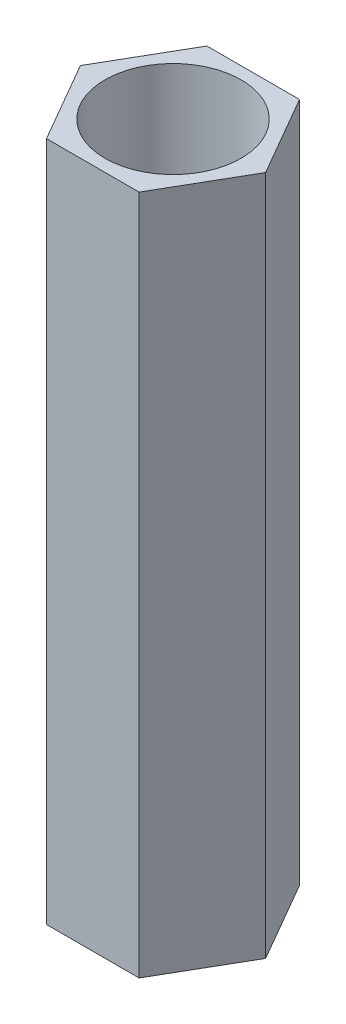
ISO-10303-21;
HEADER;
FILE_DESCRIPTION(('STEP AP214'),'2;1');
FILE_NAME('part.step','',(''),(''),'','','');
FILE_SCHEMA(('AUTOMOTIVE_DESIGN { 1 0 10303 214 1 1 1 1 }'));
ENDSEC;
DATA;
#1=APPLICATION_CONTEXT('core data for automotive mechanical design processes');
#2=APPLICATION_PROTOCOL_DEFINITION('international standard','automotive_design',2000,#1);
#3=PRODUCT_CONTEXT('',#1,'mechanical');
#4=PRODUCT('Part','Part','',(#3));
#5=PRODUCT_RELATED_PRODUCT_CATEGORY('part','',(#4));
#6=PRODUCT_DEFINITION_FORMATION('','',#4);
#7=PRODUCT_DEFINITION_CONTEXT('part definition',#1,'design');
#8=PRODUCT_DEFINITION('design','',#6,#7);
#9=PRODUCT_DEFINITION_SHAPE('','',#8);
#10=(LENGTH_UNIT() NAMED_UNIT(*) SI_UNIT(.MILLI.,.METRE.));
#11=(NAMED_UNIT(*) PLANE_ANGLE_UNIT() SI_UNIT($,.RADIAN.));
#12=(NAMED_UNIT(*) SI_UNIT($,.STERADIAN.) SOLID_ANGLE_UNIT());
#13=UNCERTAINTY_MEASURE_WITH_UNIT(LENGTH_MEASURE(1.E-05),#10,'distance_accuracy_value','');
#14=(GEOMETRIC_REPRESENTATION_CONTEXT(3) GLOBAL_UNCERTAINTY_ASSIGNED_CONTEXT((#13)) GLOBAL_UNIT_ASSIGNED_CONTEXT((#10,
#11,#12)) REPRESENTATION_CONTEXT('',''));
#15=CARTESIAN_POINT('',(0.,0.,0.));
#16=DIRECTION('',(0.,0.,1.));
#17=DIRECTION('',(1.,0.,0.));
#18=AXIS2_PLACEMENT_3D('',#15,#16,#17);
#19=CARTESIAN_POINT('',(0.,14.,0.));
#20=DIRECTION('',(0.,1.,0.));
#21=DIRECTION('',(0.,0.,1.));
#22=AXIS2_PLACEMENT_3D('',#19,#20,#21);
#23=PLANE('',#22);
#24=DIRECTION('',(0.5,0.,-0.866025403784439));
#25=VECTOR('',#24,1.);
#26=CARTESIAN_POINT('',(0.952627944162883,14.,1.65));
#27=LINE('',#26,#25);
#28=CARTESIAN_POINT('',(0.952627944162883,14.,1.65));
#29=VERTEX_POINT('',#28);
#30=CARTESIAN_POINT('',(1.90525588832576,14.,0.));
#31=VERTEX_POINT('',#30);
#32=EDGE_CURVE('E129',#29,#31,#27,.T.);
#33=ORIENTED_EDGE('',*,*,#32,.T.);
#34=DIRECTION('',(-0.5,0.,-0.866025403784438));
#35=VECTOR('',#34,1.);
#36=CARTESIAN_POINT('',(1.90525588832576,14.,0.));
#37=LINE('',#36,#35);
#38=CARTESIAN_POINT('',(0.952627944162882,14.,-1.65));
#39=VERTEX_POINT('',#38);
#40=EDGE_CURVE('E87',#31,#39,#37,.T.);
#41=ORIENTED_EDGE('',*,*,#40,.T.);
#42=DIRECTION('',(-1.,0.,0.));
#43=VECTOR('',#42,1.);
#44=CARTESIAN_POINT('',(0.952627944162882,14.,-1.65));
#45=LINE('',#44,#43);
#46=CARTESIAN_POINT('',(-0.952627944162883,14.,-1.65));
#47=VERTEX_POINT('',#46);
#48=EDGE_CURVE('E100',#39,#47,#45,.T.);
#49=ORIENTED_EDGE('',*,*,#48,.T.);
#50=DIRECTION('',(-0.5,0.,0.866025403784439));
#51=VECTOR('',#50,1.);
#52=CARTESIAN_POINT('',(-0.952627944162883,14.,-1.65));
#53=LINE('',#52,#51);
#54=CARTESIAN_POINT('',(-1.90525588832577,14.,0.));
#55=VERTEX_POINT('',#54);
#56=EDGE_CURVE('E94',#47,#55,#53,.T.);
#57=ORIENTED_EDGE('',*,*,#56,.T.);
#58=DIRECTION('',(0.5,0.,0.866025403784439));
#59=VECTOR('',#58,1.);
#60=CARTESIAN_POINT('',(-1.90525588832577,14.,0.));
#61=LINE('',#60,#59);
#62=CARTESIAN_POINT('',(-0.952627944162882,14.,1.65));
#63=VERTEX_POINT('',#62);
#64=EDGE_CURVE('E98',#55,#63,#61,.T.);
#65=ORIENTED_EDGE('',*,*,#64,.T.);
#66=DIRECTION('',(1.,0.,0.));
#67=VECTOR('',#66,1.);
#68=CARTESIAN_POINT('',(-0.952627944162882,14.,1.65));
#69=LINE('',#68,#67);
#70=EDGE_CURVE('E50',#63,#29,#69,.T.);
#71=ORIENTED_EDGE('',*,*,#70,.T.);
#72=EDGE_LOOP('',(#33,#41,#49,#57,#65,#71));
#73=FACE_BOUND('',#72,.T.);
#74=CARTESIAN_POINT('',(0.,14.,0.));
#75=DIRECTION('',(0.,1.,0.));
#76=DIRECTION('',(0.,0.,1.));
#77=AXIS2_PLACEMENT_3D('',#74,#75,#76);
#78=CIRCLE('',#77,1.4);
#79=CARTESIAN_POINT('',(0.,14.,1.4));
#80=VERTEX_POINT('',#79);
#81=EDGE_CURVE('E122',#80,#80,#78,.T.);
#82=ORIENTED_EDGE('',*,*,#81,.F.);
#83=EDGE_LOOP('',(#82));
#84=FACE_BOUND('',#83,.T.);
#85=ADVANCED_FACE('F33',(#73,#84),#23,.T.);
#86=CARTESIAN_POINT('',(0.,0.,0.));
#87=DIRECTION('',(0.,1.,0.));
#88=DIRECTION('',(0.,0.,1.));
#89=AXIS2_PLACEMENT_3D('',#86,#87,#88);
#90=PLANE('',#89);
#91=DIRECTION('',(0.5,0.,-0.866025403784439));
#92=VECTOR('',#91,1.);
#93=CARTESIAN_POINT('',(0.952627944162883,0.,1.65));
#94=LINE('',#93,#92);
#95=CARTESIAN_POINT('',(0.952627944162883,0.,1.65));
#96=VERTEX_POINT('',#95);
#97=CARTESIAN_POINT('',(1.90525588832576,0.,0.));
#98=VERTEX_POINT('',#97);
#99=EDGE_CURVE('E118',#96,#98,#94,.T.);
#100=ORIENTED_EDGE('',*,*,#99,.F.);
#101=DIRECTION('',(1.,0.,0.));
#102=VECTOR('',#101,1.);
#103=CARTESIAN_POINT('',(-0.952627944162882,0.,1.65));
#104=LINE('',#103,#102);
#105=CARTESIAN_POINT('',(-0.952627944162882,0.,1.65));
#106=VERTEX_POINT('',#105);
#107=EDGE_CURVE('E79',#106,#96,#104,.T.);
#108=ORIENTED_EDGE('',*,*,#107,.F.);
#109=DIRECTION('',(0.5,0.,0.866025403784439));
#110=VECTOR('',#109,1.);
#111=CARTESIAN_POINT('',(-1.90525588832577,0.,0.));
#112=LINE('',#111,#110);
#113=CARTESIAN_POINT('',(-1.90525588832577,0.,0.));
#114=VERTEX_POINT('',#113);
#115=EDGE_CURVE('E73',#114,#106,#112,.T.);
#116=ORIENTED_EDGE('',*,*,#115,.F.);
#117=DIRECTION('',(-0.5,0.,0.866025403784439));
#118=VECTOR('',#117,1.);
#119=CARTESIAN_POINT('',(-0.952627944162883,0.,-1.65));
#120=LINE('',#119,#118);
#121=CARTESIAN_POINT('',(-0.952627944162883,0.,-1.65));
#122=VERTEX_POINT('',#121);
#123=EDGE_CURVE('E108',#122,#114,#120,.T.);
#124=ORIENTED_EDGE('',*,*,#123,.F.);
#125=DIRECTION('',(-1.,0.,0.));
#126=VECTOR('',#125,1.);
#127=CARTESIAN_POINT('',(0.952627944162882,0.,-1.65));
#128=LINE('',#127,#126);
#129=CARTESIAN_POINT('',(0.952627944162882,0.,-1.65));
#130=VERTEX_POINT('',#129);
#131=EDGE_CURVE('E124',#130,#122,#128,.T.);
#132=ORIENTED_EDGE('',*,*,#131,.F.);
#133=DIRECTION('',(-0.5,0.,-0.866025403784438));
#134=VECTOR('',#133,1.);
#135=CARTESIAN_POINT('',(1.90525588832576,0.,0.));
#136=LINE('',#135,#134);
#137=EDGE_CURVE('E121',#98,#130,#136,.T.);
#138=ORIENTED_EDGE('',*,*,#137,.F.);
#139=EDGE_LOOP('',(#100,#108,#116,#124,#132,#138));
#140=FACE_BOUND('',#139,.T.);
#141=CARTESIAN_POINT('',(0.,0.,0.));
#142=DIRECTION('',(0.,1.,0.));
#143=DIRECTION('',(0.,0.,1.));
#144=AXIS2_PLACEMENT_3D('',#141,#142,#143);
#145=CIRCLE('',#144,1.4);
#146=CARTESIAN_POINT('',(0.,0.,1.4));
#147=VERTEX_POINT('',#146);
#148=EDGE_CURVE('E222',#147,#147,#145,.T.);
#149=ORIENTED_EDGE('',*,*,#148,.T.);
#150=EDGE_LOOP('',(#149));
#151=FACE_BOUND('',#150,.T.);
#152=ADVANCED_FACE('F138',(#140,#151),#90,.F.);
#153=CARTESIAN_POINT('',(0.952627944162883,14.,1.65));
#154=DIRECTION('',(-0.866025403784439,0.,-0.5));
#155=DIRECTION('',(-0.5,0.,0.866025403784439));
#156=AXIS2_PLACEMENT_3D('',#153,#154,#155);
#157=PLANE('',#156);
#158=ORIENTED_EDGE('',*,*,#99,.T.);
#159=DIRECTION('',(0.,-1.,0.));
#160=VECTOR('',#159,1.);
#161=CARTESIAN_POINT('',(1.90525588832576,14.,0.));
#162=LINE('',#161,#160);
#163=EDGE_CURVE('E11',#31,#98,#162,.T.);
#164=ORIENTED_EDGE('',*,*,#163,.F.);
#165=ORIENTED_EDGE('',*,*,#32,.F.);
#166=DIRECTION('',(0.,-1.,0.));
#167=VECTOR('',#166,1.);
#168=CARTESIAN_POINT('',(0.952627944162883,14.,1.65));
#169=LINE('',#168,#167);
#170=EDGE_CURVE('E114',#29,#96,#169,.T.);
#171=ORIENTED_EDGE('',*,*,#170,.T.);
#172=EDGE_LOOP('',(#158,#164,#165,#171));
#173=FACE_BOUND('',#172,.T.);
#174=ADVANCED_FACE('F35',(#173),#157,.F.);
#175=CARTESIAN_POINT('',(1.90525588832576,14.,0.));
#176=DIRECTION('',(-0.866025403784438,0.,0.5));
#177=DIRECTION('',(0.5,0.,0.866025403784439));
#178=AXIS2_PLACEMENT_3D('',#175,#176,#177);
#179=PLANE('',#178);
#180=ORIENTED_EDGE('',*,*,#137,.T.);
#181=DIRECTION('',(0.,-1.,0.));
#182=VECTOR('',#181,1.);
#183=CARTESIAN_POINT('',(0.952627944162882,14.,-1.65));
#184=LINE('',#183,#182);
#185=EDGE_CURVE('E42',#39,#130,#184,.T.);
#186=ORIENTED_EDGE('',*,*,#185,.F.);
#187=ORIENTED_EDGE('',*,*,#40,.F.);
#188=ORIENTED_EDGE('',*,*,#163,.T.);
#189=EDGE_LOOP('',(#180,#186,#187,#188));
#190=FACE_BOUND('',#189,.T.);
#191=ADVANCED_FACE('F163',(#190),#179,.F.);
#192=CARTESIAN_POINT('',(0.952627944162882,14.,-1.65));
#193=DIRECTION('',(0.,0.,1.));
#194=DIRECTION('',(1.,0.,0.));
#195=AXIS2_PLACEMENT_3D('',#192,#193,#194);
#196=PLANE('',#195);
#197=ORIENTED_EDGE('',*,*,#131,.T.);
#198=DIRECTION('',(0.,-1.,0.));
#199=VECTOR('',#198,1.);
#200=CARTESIAN_POINT('',(-0.952627944162883,14.,-1.65));
#201=LINE('',#200,#199);
#202=EDGE_CURVE('E109',#47,#122,#201,.T.);
#203=ORIENTED_EDGE('',*,*,#202,.F.);
#204=ORIENTED_EDGE('',*,*,#48,.F.);
#205=ORIENTED_EDGE('',*,*,#185,.T.);
#206=EDGE_LOOP('',(#197,#203,#204,#205));
#207=FACE_BOUND('',#206,.T.);
#208=ADVANCED_FACE('F135',(#207),#196,.F.);
#209=CARTESIAN_POINT('',(-0.952627944162883,14.,-1.65));
#210=DIRECTION('',(0.866025403784439,0.,0.5));
#211=DIRECTION('',(0.5,0.,-0.866025403784439));
#212=AXIS2_PLACEMENT_3D('',#209,#210,#211);
#213=PLANE('',#212);
#214=ORIENTED_EDGE('',*,*,#123,.T.);
#215=DIRECTION('',(0.,-1.,0.));
#216=VECTOR('',#215,1.);
#217=CARTESIAN_POINT('',(-1.90525588832577,14.,0.));
#218=LINE('',#217,#216);
#219=EDGE_CURVE('E105',#55,#114,#218,.T.);
#220=ORIENTED_EDGE('',*,*,#219,.F.);
#221=ORIENTED_EDGE('',*,*,#56,.F.);
#222=ORIENTED_EDGE('',*,*,#202,.T.);
#223=EDGE_LOOP('',(#214,#220,#221,#222));
#224=FACE_BOUND('',#223,.T.);
#225=ADVANCED_FACE('F106',(#224),#213,.F.);
#226=CARTESIAN_POINT('',(-1.90525588832577,14.,0.));
#227=DIRECTION('',(0.866025403784439,0.,-0.5));
#228=DIRECTION('',(-0.5,0.,-0.866025403784439));
#229=AXIS2_PLACEMENT_3D('',#226,#227,#228);
#230=PLANE('',#229);
#231=ORIENTED_EDGE('',*,*,#115,.T.);
#232=DIRECTION('',(0.,-1.,0.));
#233=VECTOR('',#232,1.);
#234=CARTESIAN_POINT('',(-0.952627944162882,14.,1.65));
#235=LINE('',#234,#233);
#236=EDGE_CURVE('E110',#63,#106,#235,.T.);
#237=ORIENTED_EDGE('',*,*,#236,.F.);
#238=ORIENTED_EDGE('',*,*,#64,.F.);
#239=ORIENTED_EDGE('',*,*,#219,.T.);
#240=EDGE_LOOP('',(#231,#237,#238,#239));
#241=FACE_BOUND('',#240,.T.);
#242=ADVANCED_FACE('F112',(#241),#230,.F.);
#243=CARTESIAN_POINT('',(-0.952627944162882,14.,1.65));
#244=DIRECTION('',(0.,0.,-1.));
#245=DIRECTION('',(-1.,0.,0.));
#246=AXIS2_PLACEMENT_3D('',#243,#244,#245);
#247=PLANE('',#246);
#248=ORIENTED_EDGE('',*,*,#107,.T.);
#249=ORIENTED_EDGE('',*,*,#170,.F.);
#250=ORIENTED_EDGE('',*,*,#70,.F.);
#251=ORIENTED_EDGE('',*,*,#236,.T.);
#252=EDGE_LOOP('',(#248,#249,#250,#251));
#253=FACE_BOUND('',#252,.T.);
#254=ADVANCED_FACE('F143',(#253),#247,.F.);
#255=CARTESIAN_POINT('',(0.,14.,0.));
#256=DIRECTION('',(0.,-1.,0.));
#257=DIRECTION('',(0.,0.,-1.));
#258=AXIS2_PLACEMENT_3D('',#255,#256,#257);
#259=CYLINDRICAL_SURFACE('',#258,1.4);
#260=ORIENTED_EDGE('',*,*,#81,.T.);
#261=EDGE_LOOP('',(#260));
#262=FACE_BOUND('',#261,.T.);
#263=ORIENTED_EDGE('',*,*,#148,.F.);
#264=EDGE_LOOP('',(#263));
#265=FACE_BOUND('',#264,.T.);
#266=ADVANCED_FACE('F145',(#262,#265),#259,.F.);
#267=CLOSED_SHELL('',(#85,#152,#174,#191,#208,#225,#242,#254,#266));
#268=MANIFOLD_SOLID_BREP('B2',#267);
#269=ADVANCED_BREP_SHAPE_REPRESENTATION('',(#18,#268),#14);
#270=SHAPE_DEFINITION_REPRESENTATION(#9,#269);
ENDSEC;
END-ISO-10303-21;
